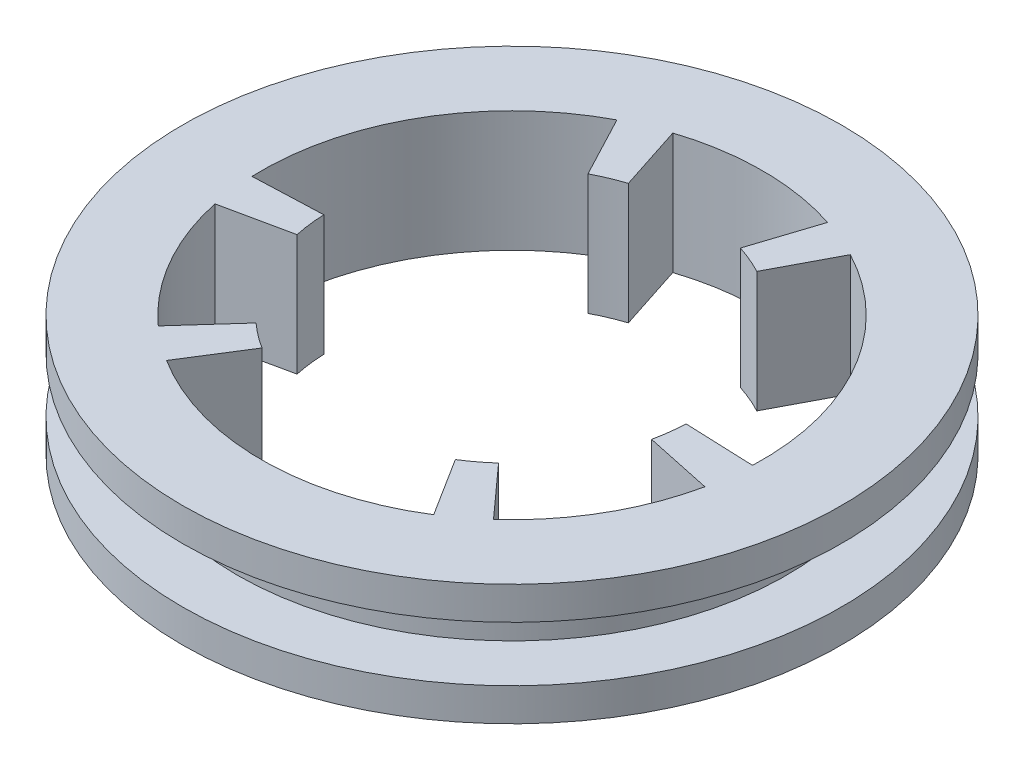
ISO-10303-21;
HEADER;
FILE_DESCRIPTION(('STEP AP214'),'2;1');
FILE_NAME('part.step','',(''),(''),'','','');
FILE_SCHEMA(('AUTOMOTIVE_DESIGN { 1 0 10303 214 1 1 1 1 }'));
ENDSEC;
DATA;
#1=APPLICATION_CONTEXT('core data for automotive mechanical design processes');
#2=APPLICATION_PROTOCOL_DEFINITION('international standard','automotive_design',2000,#1);
#3=PRODUCT_CONTEXT('',#1,'mechanical');
#4=PRODUCT('Part','Part','',(#3));
#5=PRODUCT_RELATED_PRODUCT_CATEGORY('part','',(#4));
#6=PRODUCT_DEFINITION_FORMATION('','',#4);
#7=PRODUCT_DEFINITION_CONTEXT('part definition',#1,'design');
#8=PRODUCT_DEFINITION('design','',#6,#7);
#9=PRODUCT_DEFINITION_SHAPE('','',#8);
#10=(LENGTH_UNIT() NAMED_UNIT(*) SI_UNIT(.MILLI.,.METRE.));
#11=(NAMED_UNIT(*) PLANE_ANGLE_UNIT() SI_UNIT($,.RADIAN.));
#12=(NAMED_UNIT(*) SI_UNIT($,.STERADIAN.) SOLID_ANGLE_UNIT());
#13=UNCERTAINTY_MEASURE_WITH_UNIT(LENGTH_MEASURE(1.E-05),#10,'distance_accuracy_value','');
#14=(GEOMETRIC_REPRESENTATION_CONTEXT(3) GLOBAL_UNCERTAINTY_ASSIGNED_CONTEXT((#13)) GLOBAL_UNIT_ASSIGNED_CONTEXT((#10,
#11,#12)) REPRESENTATION_CONTEXT('',''));
#15=CARTESIAN_POINT('',(0.,0.,0.));
#16=DIRECTION('',(0.,0.,1.));
#17=DIRECTION('',(1.,0.,0.));
#18=AXIS2_PLACEMENT_3D('',#15,#16,#17);
#19=CARTESIAN_POINT('',(-25.,2.5,0.));
#20=DIRECTION('',(0.,-1.,0.));
#21=DIRECTION('',(0.,0.,-1.));
#22=AXIS2_PLACEMENT_3D('',#19,#20,#21);
#23=PLANE('',#22);
#24=CARTESIAN_POINT('',(0.,2.5,0.));
#25=DIRECTION('',(0.,1.,0.));
#26=DIRECTION('',(0.,0.,1.));
#27=AXIS2_PLACEMENT_3D('',#24,#25,#26);
#28=CIRCLE('',#27,25.);
#29=CARTESIAN_POINT('',(0.,2.5,25.));
#30=VERTEX_POINT('',#29);
#31=EDGE_CURVE('E204',#30,#30,#28,.T.);
#32=ORIENTED_EDGE('',*,*,#31,.T.);
#33=EDGE_LOOP('',(#32));
#34=FACE_BOUND('',#33,.T.);
#35=CARTESIAN_POINT('',(0.,2.5,0.));
#36=DIRECTION('',(0.,1.,0.));
#37=DIRECTION('',(0.,0.,1.));
#38=AXIS2_PLACEMENT_3D('',#35,#36,#37);
#39=CIRCLE('',#38,30.);
#40=CARTESIAN_POINT('',(0.,2.5,30.));
#41=VERTEX_POINT('',#40);
#42=EDGE_CURVE('E11',#41,#41,#39,.T.);
#43=ORIENTED_EDGE('',*,*,#42,.F.);
#44=EDGE_LOOP('',(#43));
#45=FACE_BOUND('',#44,.T.);
#46=ADVANCED_FACE('F38',(#34,#45),#23,.T.);
#47=CARTESIAN_POINT('',(0.,19.9874111465534,0.));
#48=DIRECTION('',(0.,1.,0.));
#49=DIRECTION('',(0.,0.,1.));
#50=AXIS2_PLACEMENT_3D('',#47,#48,#49);
#51=CYLINDRICAL_SURFACE('',#50,30.);
#52=ORIENTED_EDGE('',*,*,#42,.T.);
#53=EDGE_LOOP('',(#52));
#54=FACE_BOUND('',#53,.T.);
#55=CARTESIAN_POINT('',(0.,5.5,0.));
#56=DIRECTION('',(0.,1.,0.));
#57=DIRECTION('',(0.,0.,1.));
#58=AXIS2_PLACEMENT_3D('',#55,#56,#57);
#59=CIRCLE('',#58,30.);
#60=CARTESIAN_POINT('',(0.,5.5,30.));
#61=VERTEX_POINT('',#60);
#62=EDGE_CURVE('E45',#61,#61,#59,.T.);
#63=ORIENTED_EDGE('',*,*,#62,.F.);
#64=EDGE_LOOP('',(#63));
#65=FACE_BOUND('',#64,.T.);
#66=ADVANCED_FACE('F339',(#54,#65),#51,.T.);
#67=CARTESIAN_POINT('',(-30.,5.5,0.));
#68=DIRECTION('',(0.,1.,0.));
#69=DIRECTION('',(0.,0.,1.));
#70=AXIS2_PLACEMENT_3D('',#67,#68,#69);
#71=PLANE('',#70);
#72=CARTESIAN_POINT('',(0.,5.5,0.));
#73=DIRECTION('',(0.,1.,0.));
#74=DIRECTION('',(0.,0.,1.));
#75=AXIS2_PLACEMENT_3D('',#72,#73,#74);
#76=CIRCLE('',#75,22.8);
#77=CARTESIAN_POINT('',(15.2561778249819,5.5,16.9437020208847));
#78=VERTEX_POINT('',#77);
#79=CARTESIAN_POINT('',(22.3017652967308,5.5,4.740386550645));
#80=VERTEX_POINT('',#79);
#81=EDGE_CURVE('E52',#78,#80,#76,.T.);
#82=ORIENTED_EDGE('',*,*,#81,.F.);
#83=DIRECTION('',(-0.669130606358854,0.,-0.743144825477398));
#84=VECTOR('',#83,1.);
#85=CARTESIAN_POINT('',(0.,5.5,0.));
#86=LINE('',#85,#84);
#87=CARTESIAN_POINT('',(11.0406550049211,5.5,12.2618896203771));
#88=VERTEX_POINT('',#87);
#89=EDGE_CURVE('E210',#78,#88,#86,.T.);
#90=ORIENTED_EDGE('',*,*,#89,.T.);
#91=CARTESIAN_POINT('',(0.,5.5,0.));
#92=DIRECTION('',(0.,1.,0.));
#93=DIRECTION('',(0.,0.,1.));
#94=AXIS2_PLACEMENT_3D('',#91,#92,#93);
#95=CIRCLE('',#94,16.5);
#96=CARTESIAN_POINT('',(8.79989737156065,5.5,13.9575));
#97=VERTEX_POINT('',#96);
#98=EDGE_CURVE('E229',#97,#88,#95,.T.);
#99=ORIENTED_EDGE('',*,*,#98,.F.);
#100=DIRECTION('',(0.533327113427918,0.,0.845909090909091));
#101=VECTOR('',#100,1.);
#102=CARTESIAN_POINT('',(0.,5.5,0.));
#103=LINE('',#102,#101);
#104=CARTESIAN_POINT('',(12.1598581861565,5.5,19.2867272727273));
#105=VERTEX_POINT('',#104);
#106=EDGE_CURVE('E275',#97,#105,#103,.T.);
#107=ORIENTED_EDGE('',*,*,#106,.T.);
#108=CARTESIAN_POINT('',(0.,5.5,0.));
#109=DIRECTION('',(0.,1.,0.));
#110=DIRECTION('',(0.,0.,1.));
#111=AXIS2_PLACEMENT_3D('',#108,#109,#110);
#112=CIRCLE('',#111,22.8);
#113=CARTESIAN_POINT('',(-12.1598581861565,5.5,19.2867272727273));
#114=VERTEX_POINT('',#113);
#115=EDGE_CURVE('E272',#114,#105,#112,.T.);
#116=ORIENTED_EDGE('',*,*,#115,.F.);
#117=DIRECTION('',(-0.533327113427918,0.,0.845909090909091));
#118=VECTOR('',#117,1.);
#119=CARTESIAN_POINT('',(0.,5.5,0.));
#120=LINE('',#119,#118);
#121=CARTESIAN_POINT('',(-8.79989737156065,5.5,13.9575));
#122=VERTEX_POINT('',#121);
#123=EDGE_CURVE('E269',#122,#114,#120,.T.);
#124=ORIENTED_EDGE('',*,*,#123,.F.);
#125=CARTESIAN_POINT('',(-11.0406550049214,5.5,12.2618896203769));
#126=VERTEX_POINT('',#125);
#127=EDGE_CURVE('E268',#126,#122,#95,.T.);
#128=ORIENTED_EDGE('',*,*,#127,.F.);
#129=DIRECTION('',(0.66913060635886,0.,-0.743144825477392));
#130=VECTOR('',#129,1.);
#131=CARTESIAN_POINT('',(-1.50830640652339E-13,5.5,-1.35808518847401E-13));
#132=LINE('',#131,#130);
#133=CARTESIAN_POINT('',(-15.2561778249822,5.5,16.9437020208844));
#134=VERTEX_POINT('',#133);
#135=EDGE_CURVE('E265',#134,#126,#132,.T.);
#136=ORIENTED_EDGE('',*,*,#135,.F.);
#137=CARTESIAN_POINT('',(0.,5.5,0.));
#138=DIRECTION('',(0.,1.,0.));
#139=DIRECTION('',(0.,0.,1.));
#140=AXIS2_PLACEMENT_3D('',#137,#138,#139);
#141=CIRCLE('',#140,22.8);
#142=CARTESIAN_POINT('',(-22.3017652967308,5.5,4.7403865506446));
#143=VERTEX_POINT('',#142);
#144=EDGE_CURVE('E262',#143,#134,#141,.T.);
#145=ORIENTED_EDGE('',*,*,#144,.F.);
#146=DIRECTION('',(0.978147600733809,0.,-0.207911690817745));
#147=VECTOR('',#146,1.);
#148=CARTESIAN_POINT('',(0.,5.5,0.));
#149=LINE('',#148,#147);
#150=CARTESIAN_POINT('',(-16.1394354121078,5.5,3.4305428984928));
#151=VERTEX_POINT('',#150);
#152=EDGE_CURVE('E259',#143,#151,#149,.T.);
#153=ORIENTED_EDGE('',*,*,#152,.T.);
#154=CARTESIAN_POINT('',(-16.4874982591016,5.5,0.642184674467354));
#155=VERTEX_POINT('',#154);
#156=EDGE_CURVE('E258',#155,#151,#95,.T.);
#157=ORIENTED_EDGE('',*,*,#156,.F.);
#158=DIRECTION('',(-0.999242318733432,0.,0.0389202833010516));
#159=VECTOR('',#158,1.);
#160=CARTESIAN_POINT('',(0.,5.5,0.));
#161=LINE('',#160,#159);
#162=CARTESIAN_POINT('',(-22.7827248671223,5.5,0.887382459263979));
#163=VERTEX_POINT('',#162);
#164=EDGE_CURVE('E255',#155,#163,#161,.T.);
#165=ORIENTED_EDGE('',*,*,#164,.T.);
#166=CARTESIAN_POINT('',(0.,5.5,0.));
#167=DIRECTION('',(0.,1.,0.));
#168=DIRECTION('',(0.,0.,1.));
#169=AXIS2_PLACEMENT_3D('',#166,#167,#168);
#170=CIRCLE('',#169,22.8);
#171=CARTESIAN_POINT('',(-10.6228666809656,5.5,-20.1741097319914));
#172=VERTEX_POINT('',#171);
#173=EDGE_CURVE('E252',#172,#163,#170,.T.);
#174=ORIENTED_EDGE('',*,*,#173,.F.);
#175=DIRECTION('',(-0.46591520530551,0.,-0.884829374210149));
#176=VECTOR('',#175,1.);
#177=CARTESIAN_POINT('',(0.,5.5,0.));
#178=LINE('',#177,#176);
#179=CARTESIAN_POINT('',(-7.68760088754091,5.5,-14.5996846744675));
#180=VERTEX_POINT('',#179);
#181=EDGE_CURVE('E249',#180,#172,#178,.T.);
#182=ORIENTED_EDGE('',*,*,#181,.F.);
#183=CARTESIAN_POINT('',(-5.0987804071865,5.5,-15.6924325188701));
#184=VERTEX_POINT('',#183);
#185=EDGE_CURVE('E248',#184,#180,#95,.T.);
#186=ORIENTED_EDGE('',*,*,#185,.F.);
#187=DIRECTION('',(0.309016994374939,0.,0.951056516295156));
#188=VECTOR('',#187,1.);
#189=CARTESIAN_POINT('',(0.,5.5,0.));
#190=LINE('',#189,#188);
#191=CARTESIAN_POINT('',(-7.04558747174862,5.5,-21.6840885715296));
#192=VERTEX_POINT('',#191);
#193=EDGE_CURVE('E245',#192,#184,#190,.T.);
#194=ORIENTED_EDGE('',*,*,#193,.F.);
#195=CARTESIAN_POINT('',(0.,5.5,0.));
#196=DIRECTION('',(0.,1.,0.));
#197=DIRECTION('',(0.,0.,1.));
#198=AXIS2_PLACEMENT_3D('',#195,#196,#197);
#199=CIRCLE('',#198,22.8);
#200=CARTESIAN_POINT('',(7.04558747174912,5.5,-21.6840885715294));
#201=VERTEX_POINT('',#200);
#202=EDGE_CURVE('E242',#201,#192,#199,.T.);
#203=ORIENTED_EDGE('',*,*,#202,.F.);
#204=DIRECTION('',(-0.309016994374961,0.,0.951056516295149));
#205=VECTOR('',#204,1.);
#206=CARTESIAN_POINT('',(0.,5.5,0.));
#207=LINE('',#206,#205);
#208=CARTESIAN_POINT('',(5.09878040718686,5.5,-15.69243251887));
#209=VERTEX_POINT('',#208);
#210=EDGE_CURVE('E239',#201,#209,#207,.T.);
#211=ORIENTED_EDGE('',*,*,#210,.T.);
#212=CARTESIAN_POINT('',(7.68760088754112,5.5,-14.5996846744674));
#213=VERTEX_POINT('',#212);
#214=EDGE_CURVE('E230',#213,#209,#95,.T.);
#215=ORIENTED_EDGE('',*,*,#214,.F.);
#216=DIRECTION('',(0.465915205305522,0.,-0.884829374210143));
#217=VECTOR('',#216,1.);
#218=CARTESIAN_POINT('',(0.,5.5,0.));
#219=LINE('',#218,#217);
#220=CARTESIAN_POINT('',(10.6228666809659,5.5,-20.1741097319913));
#221=VERTEX_POINT('',#220);
#222=EDGE_CURVE('E236',#213,#221,#219,.T.);
#223=ORIENTED_EDGE('',*,*,#222,.T.);
#224=CARTESIAN_POINT('',(0.,5.5,0.));
#225=DIRECTION('',(0.,1.,0.));
#226=DIRECTION('',(0.,0.,1.));
#227=AXIS2_PLACEMENT_3D('',#224,#225,#226);
#228=CIRCLE('',#227,22.8);
#229=CARTESIAN_POINT('',(22.7827248671222,5.5,0.887382459264295));
#230=VERTEX_POINT('',#229);
#231=EDGE_CURVE('E233',#230,#221,#228,.T.);
#232=ORIENTED_EDGE('',*,*,#231,.F.);
#233=DIRECTION('',(0.999242318733432,0.,0.0389202833010652));
#234=VECTOR('',#233,1.);
#235=CARTESIAN_POINT('',(0.,5.5,0.));
#236=LINE('',#235,#234);
#237=CARTESIAN_POINT('',(16.4874982591016,5.5,0.642184674467584));
#238=VERTEX_POINT('',#237);
#239=EDGE_CURVE('E228',#238,#230,#236,.T.);
#240=ORIENTED_EDGE('',*,*,#239,.F.);
#241=CARTESIAN_POINT('',(16.1394354121078,5.5,3.4305428984931));
#242=VERTEX_POINT('',#241);
#243=EDGE_CURVE('E225',#242,#238,#95,.T.);
#244=ORIENTED_EDGE('',*,*,#243,.F.);
#245=DIRECTION('',(-0.978147600733805,0.,-0.207911690817763));
#246=VECTOR('',#245,1.);
#247=CARTESIAN_POINT('',(0.,5.5,0.));
#248=LINE('',#247,#246);
#249=EDGE_CURVE('E218',#80,#242,#248,.T.);
#250=ORIENTED_EDGE('',*,*,#249,.F.);
#251=EDGE_LOOP('',(#82,#90,#99,#107,#116,#124,#128,#136,#145,#153,#157,#165,#174,#182,#186,#194,
#203,#211,#215,#223,#232,#240,#244,#250));
#252=FACE_BOUND('',#251,.T.);
#253=ORIENTED_EDGE('',*,*,#62,.T.);
#254=EDGE_LOOP('',(#253));
#255=FACE_BOUND('',#254,.T.);
#256=ADVANCED_FACE('F337',(#252,#255),#71,.T.);
#257=CARTESIAN_POINT('',(-30.,-5.5,0.));
#258=DIRECTION('',(0.,-1.,0.));
#259=DIRECTION('',(0.,0.,-1.));
#260=AXIS2_PLACEMENT_3D('',#257,#258,#259);
#261=PLANE('',#260);
#262=CARTESIAN_POINT('',(0.,-5.5,0.));
#263=DIRECTION('',(0.,-1.,0.));
#264=DIRECTION('',(0.,0.,-1.));
#265=AXIS2_PLACEMENT_3D('',#262,#263,#264);
#266=CIRCLE('',#265,22.8);
#267=CARTESIAN_POINT('',(15.2561778249819,-5.5,16.9437020208847));
#268=VERTEX_POINT('',#267);
#269=CARTESIAN_POINT('',(22.3017652967308,-5.5,4.740386550645));
#270=VERTEX_POINT('',#269);
#271=EDGE_CURVE('E208',#268,#270,#266,.F.);
#272=ORIENTED_EDGE('',*,*,#271,.T.);
#273=DIRECTION('',(-0.978147600733805,0.,-0.207911690817763));
#274=VECTOR('',#273,1.);
#275=CARTESIAN_POINT('',(0.,-5.5,0.));
#276=LINE('',#275,#274);
#277=CARTESIAN_POINT('',(16.1394354121078,-5.5,3.4305428984931));
#278=VERTEX_POINT('',#277);
#279=EDGE_CURVE('E197',#270,#278,#276,.T.);
#280=ORIENTED_EDGE('',*,*,#279,.T.);
#281=CARTESIAN_POINT('',(0.,-5.5,0.));
#282=DIRECTION('',(0.,-1.,0.));
#283=DIRECTION('',(0.,0.,-1.));
#284=AXIS2_PLACEMENT_3D('',#281,#282,#283);
#285=CIRCLE('',#284,16.5);
#286=CARTESIAN_POINT('',(16.4874982591016,-5.5,0.642184674467584));
#287=VERTEX_POINT('',#286);
#288=EDGE_CURVE('E502',#278,#287,#285,.F.);
#289=ORIENTED_EDGE('',*,*,#288,.T.);
#290=DIRECTION('',(0.999242318733432,0.,0.0389202833010652));
#291=VECTOR('',#290,1.);
#292=CARTESIAN_POINT('',(0.,-5.5,0.));
#293=LINE('',#292,#291);
#294=CARTESIAN_POINT('',(22.7827248671222,-5.5,0.887382459264295));
#295=VERTEX_POINT('',#294);
#296=EDGE_CURVE('E499',#287,#295,#293,.T.);
#297=ORIENTED_EDGE('',*,*,#296,.T.);
#298=CARTESIAN_POINT('',(0.,-5.5,0.));
#299=DIRECTION('',(0.,-1.,0.));
#300=DIRECTION('',(0.,0.,-1.));
#301=AXIS2_PLACEMENT_3D('',#298,#299,#300);
#302=CIRCLE('',#301,22.8);
#303=CARTESIAN_POINT('',(10.6228666809659,-5.5,-20.1741097319913));
#304=VERTEX_POINT('',#303);
#305=EDGE_CURVE('E496',#295,#304,#302,.F.);
#306=ORIENTED_EDGE('',*,*,#305,.T.);
#307=DIRECTION('',(0.465915205305522,0.,-0.884829374210143));
#308=VECTOR('',#307,1.);
#309=CARTESIAN_POINT('',(0.,-5.5,0.));
#310=LINE('',#309,#308);
#311=CARTESIAN_POINT('',(7.68760088754112,-5.5,-14.5996846744674));
#312=VERTEX_POINT('',#311);
#313=EDGE_CURVE('E494',#312,#304,#310,.T.);
#314=ORIENTED_EDGE('',*,*,#313,.F.);
#315=CARTESIAN_POINT('',(0.,-5.5,0.));
#316=DIRECTION('',(0.,-1.,0.));
#317=DIRECTION('',(0.,0.,-1.));
#318=AXIS2_PLACEMENT_3D('',#315,#316,#317);
#319=CIRCLE('',#318,16.5);
#320=CARTESIAN_POINT('',(5.09878040718686,-5.5,-15.69243251887));
#321=VERTEX_POINT('',#320);
#322=EDGE_CURVE('E491',#312,#321,#319,.F.);
#323=ORIENTED_EDGE('',*,*,#322,.T.);
#324=DIRECTION('',(-0.309016994374961,0.,0.951056516295149));
#325=VECTOR('',#324,1.);
#326=CARTESIAN_POINT('',(0.,-5.5,0.));
#327=LINE('',#326,#325);
#328=CARTESIAN_POINT('',(7.04558747174912,-5.5,-21.6840885715294));
#329=VERTEX_POINT('',#328);
#330=EDGE_CURVE('E489',#329,#321,#327,.T.);
#331=ORIENTED_EDGE('',*,*,#330,.F.);
#332=CARTESIAN_POINT('',(0.,-5.5,0.));
#333=DIRECTION('',(0.,-1.,0.));
#334=DIRECTION('',(0.,0.,-1.));
#335=AXIS2_PLACEMENT_3D('',#332,#333,#334);
#336=CIRCLE('',#335,22.8);
#337=CARTESIAN_POINT('',(-7.04558747174862,-5.5,-21.6840885715296));
#338=VERTEX_POINT('',#337);
#339=EDGE_CURVE('E486',#329,#338,#336,.F.);
#340=ORIENTED_EDGE('',*,*,#339,.T.);
#341=DIRECTION('',(0.309016994374939,0.,0.951056516295156));
#342=VECTOR('',#341,1.);
#343=CARTESIAN_POINT('',(0.,-5.5,0.));
#344=LINE('',#343,#342);
#345=CARTESIAN_POINT('',(-5.0987804071865,-5.5,-15.6924325188701));
#346=VERTEX_POINT('',#345);
#347=EDGE_CURVE('E483',#338,#346,#344,.T.);
#348=ORIENTED_EDGE('',*,*,#347,.T.);
#349=CARTESIAN_POINT('',(0.,-5.5,0.));
#350=DIRECTION('',(0.,-1.,0.));
#351=DIRECTION('',(0.,0.,-1.));
#352=AXIS2_PLACEMENT_3D('',#349,#350,#351);
#353=CIRCLE('',#352,16.5);
#354=CARTESIAN_POINT('',(-7.68760088754091,-5.5,-14.5996846744675));
#355=VERTEX_POINT('',#354);
#356=EDGE_CURVE('E480',#346,#355,#353,.F.);
#357=ORIENTED_EDGE('',*,*,#356,.T.);
#358=DIRECTION('',(-0.46591520530551,0.,-0.884829374210149));
#359=VECTOR('',#358,1.);
#360=CARTESIAN_POINT('',(0.,-5.5,0.));
#361=LINE('',#360,#359);
#362=CARTESIAN_POINT('',(-10.6228666809656,-5.5,-20.1741097319914));
#363=VERTEX_POINT('',#362);
#364=EDGE_CURVE('E477',#355,#363,#361,.T.);
#365=ORIENTED_EDGE('',*,*,#364,.T.);
#366=CARTESIAN_POINT('',(0.,-5.5,0.));
#367=DIRECTION('',(0.,-1.,0.));
#368=DIRECTION('',(0.,0.,-1.));
#369=AXIS2_PLACEMENT_3D('',#366,#367,#368);
#370=CIRCLE('',#369,22.8);
#371=CARTESIAN_POINT('',(-22.7827248671223,-5.5,0.887382459263979));
#372=VERTEX_POINT('',#371);
#373=EDGE_CURVE('E474',#363,#372,#370,.F.);
#374=ORIENTED_EDGE('',*,*,#373,.T.);
#375=DIRECTION('',(-0.999242318733432,0.,0.0389202833010516));
#376=VECTOR('',#375,1.);
#377=CARTESIAN_POINT('',(0.,-5.5,0.));
#378=LINE('',#377,#376);
#379=CARTESIAN_POINT('',(-16.4874982591016,-5.5,0.642184674467354));
#380=VERTEX_POINT('',#379);
#381=EDGE_CURVE('E472',#380,#372,#378,.T.);
#382=ORIENTED_EDGE('',*,*,#381,.F.);
#383=CARTESIAN_POINT('',(0.,-5.5,0.));
#384=DIRECTION('',(0.,-1.,0.));
#385=DIRECTION('',(0.,0.,-1.));
#386=AXIS2_PLACEMENT_3D('',#383,#384,#385);
#387=CIRCLE('',#386,16.5);
#388=CARTESIAN_POINT('',(-16.1394354121078,-5.5,3.4305428984928));
#389=VERTEX_POINT('',#388);
#390=EDGE_CURVE('E469',#380,#389,#387,.F.);
#391=ORIENTED_EDGE('',*,*,#390,.T.);
#392=DIRECTION('',(0.978147600733809,0.,-0.207911690817745));
#393=VECTOR('',#392,1.);
#394=CARTESIAN_POINT('',(0.,-5.5,0.));
#395=LINE('',#394,#393);
#396=CARTESIAN_POINT('',(-22.3017652967308,-5.5,4.7403865506446));
#397=VERTEX_POINT('',#396);
#398=EDGE_CURVE('E467',#397,#389,#395,.T.);
#399=ORIENTED_EDGE('',*,*,#398,.F.);
#400=CARTESIAN_POINT('',(0.,-5.5,0.));
#401=DIRECTION('',(0.,-1.,0.));
#402=DIRECTION('',(0.,0.,-1.));
#403=AXIS2_PLACEMENT_3D('',#400,#401,#402);
#404=CIRCLE('',#403,22.8);
#405=CARTESIAN_POINT('',(-15.2561778249822,-5.5,16.9437020208844));
#406=VERTEX_POINT('',#405);
#407=EDGE_CURVE('E464',#397,#406,#404,.F.);
#408=ORIENTED_EDGE('',*,*,#407,.T.);
#409=DIRECTION('',(0.66913060635886,0.,-0.743144825477392));
#410=VECTOR('',#409,1.);
#411=CARTESIAN_POINT('',(-1.50830640652339E-13,-5.5,-1.35808518847401E-13));
#412=LINE('',#411,#410);
#413=CARTESIAN_POINT('',(-11.0406550049214,-5.5,12.2618896203769));
#414=VERTEX_POINT('',#413);
#415=EDGE_CURVE('E461',#406,#414,#412,.T.);
#416=ORIENTED_EDGE('',*,*,#415,.T.);
#417=CARTESIAN_POINT('',(0.,-5.5,0.));
#418=DIRECTION('',(0.,-1.,0.));
#419=DIRECTION('',(0.,0.,-1.));
#420=AXIS2_PLACEMENT_3D('',#417,#418,#419);
#421=CIRCLE('',#420,16.5);
#422=CARTESIAN_POINT('',(-8.79989737156065,-5.5,13.9575));
#423=VERTEX_POINT('',#422);
#424=EDGE_CURVE('E458',#414,#423,#421,.F.);
#425=ORIENTED_EDGE('',*,*,#424,.T.);
#426=DIRECTION('',(-0.533327113427918,0.,0.845909090909091));
#427=VECTOR('',#426,1.);
#428=CARTESIAN_POINT('',(0.,-5.5,0.));
#429=LINE('',#428,#427);
#430=CARTESIAN_POINT('',(-12.1598581861565,-5.5,19.2867272727273));
#431=VERTEX_POINT('',#430);
#432=EDGE_CURVE('E455',#423,#431,#429,.T.);
#433=ORIENTED_EDGE('',*,*,#432,.T.);
#434=CARTESIAN_POINT('',(0.,-5.5,0.));
#435=DIRECTION('',(0.,-1.,0.));
#436=DIRECTION('',(0.,0.,-1.));
#437=AXIS2_PLACEMENT_3D('',#434,#435,#436);
#438=CIRCLE('',#437,22.8);
#439=CARTESIAN_POINT('',(12.1598581861565,-5.5,19.2867272727273));
#440=VERTEX_POINT('',#439);
#441=EDGE_CURVE('E451',#431,#440,#438,.F.);
#442=ORIENTED_EDGE('',*,*,#441,.T.);
#443=DIRECTION('',(0.533327113427918,0.,0.845909090909091));
#444=VECTOR('',#443,1.);
#445=CARTESIAN_POINT('',(0.,-5.5,0.));
#446=LINE('',#445,#444);
#447=CARTESIAN_POINT('',(8.79989737156065,-5.5,13.9575));
#448=VERTEX_POINT('',#447);
#449=EDGE_CURVE('E450',#448,#440,#446,.T.);
#450=ORIENTED_EDGE('',*,*,#449,.F.);
#451=CARTESIAN_POINT('',(0.,-5.5,0.));
#452=DIRECTION('',(0.,-1.,0.));
#453=DIRECTION('',(0.,0.,-1.));
#454=AXIS2_PLACEMENT_3D('',#451,#452,#453);
#455=CIRCLE('',#454,16.5);
#456=CARTESIAN_POINT('',(11.0406550049211,-5.5,12.2618896203771));
#457=VERTEX_POINT('',#456);
#458=EDGE_CURVE('E220',#448,#457,#455,.F.);
#459=ORIENTED_EDGE('',*,*,#458,.T.);
#460=DIRECTION('',(-0.669130606358854,0.,-0.743144825477398));
#461=VECTOR('',#460,1.);
#462=CARTESIAN_POINT('',(0.,-5.5,0.));
#463=LINE('',#462,#461);
#464=EDGE_CURVE('E216',#268,#457,#463,.T.);
#465=ORIENTED_EDGE('',*,*,#464,.F.);
#466=EDGE_LOOP('',(#272,#280,#289,#297,#306,#314,#323,#331,#340,#348,#357,#365,#374,#382,#391,
#399,#408,#416,#425,#433,#442,#450,#459,#465));
#467=FACE_BOUND('',#466,.T.);
#468=CARTESIAN_POINT('',(0.,-5.5,0.));
#469=DIRECTION('',(0.,1.,0.));
#470=DIRECTION('',(0.,0.,1.));
#471=AXIS2_PLACEMENT_3D('',#468,#469,#470);
#472=CIRCLE('',#471,30.);
#473=CARTESIAN_POINT('',(0.,-5.5,30.));
#474=VERTEX_POINT('',#473);
#475=EDGE_CURVE('E332',#474,#474,#472,.T.);
#476=ORIENTED_EDGE('',*,*,#475,.F.);
#477=EDGE_LOOP('',(#476));
#478=FACE_BOUND('',#477,.T.);
#479=ADVANCED_FACE('F213',(#467,#478),#261,.T.);
#480=CARTESIAN_POINT('',(0.,19.9874111465534,0.));
#481=DIRECTION('',(0.,1.,0.));
#482=DIRECTION('',(0.,0.,1.));
#483=AXIS2_PLACEMENT_3D('',#480,#481,#482);
#484=CYLINDRICAL_SURFACE('',#483,30.);
#485=ORIENTED_EDGE('',*,*,#475,.T.);
#486=EDGE_LOOP('',(#485));
#487=FACE_BOUND('',#486,.T.);
#488=CARTESIAN_POINT('',(0.,-2.5,0.));
#489=DIRECTION('',(0.,1.,0.));
#490=DIRECTION('',(0.,0.,1.));
#491=AXIS2_PLACEMENT_3D('',#488,#489,#490);
#492=CIRCLE('',#491,30.);
#493=CARTESIAN_POINT('',(0.,-2.5,30.));
#494=VERTEX_POINT('',#493);
#495=EDGE_CURVE('E329',#494,#494,#492,.T.);
#496=ORIENTED_EDGE('',*,*,#495,.F.);
#497=EDGE_LOOP('',(#496));
#498=FACE_BOUND('',#497,.T.);
#499=ADVANCED_FACE('F353',(#487,#498),#484,.T.);
#500=CARTESIAN_POINT('',(-25.,-2.5,0.));
#501=DIRECTION('',(0.,1.,0.));
#502=DIRECTION('',(0.,0.,1.));
#503=AXIS2_PLACEMENT_3D('',#500,#501,#502);
#504=PLANE('',#503);
#505=ORIENTED_EDGE('',*,*,#495,.T.);
#506=EDGE_LOOP('',(#505));
#507=FACE_BOUND('',#506,.T.);
#508=CARTESIAN_POINT('',(0.,-2.5,0.));
#509=DIRECTION('',(0.,1.,0.));
#510=DIRECTION('',(0.,0.,1.));
#511=AXIS2_PLACEMENT_3D('',#508,#509,#510);
#512=CIRCLE('',#511,25.);
#513=CARTESIAN_POINT('',(0.,-2.5,25.));
#514=VERTEX_POINT('',#513);
#515=EDGE_CURVE('E326',#514,#514,#512,.T.);
#516=ORIENTED_EDGE('',*,*,#515,.F.);
#517=EDGE_LOOP('',(#516));
#518=FACE_BOUND('',#517,.T.);
#519=ADVANCED_FACE('F356',(#507,#518),#504,.T.);
#520=CARTESIAN_POINT('',(0.,19.9874111465534,0.));
#521=DIRECTION('',(0.,1.,0.));
#522=DIRECTION('',(0.,0.,1.));
#523=AXIS2_PLACEMENT_3D('',#520,#521,#522);
#524=CYLINDRICAL_SURFACE('',#523,25.);
#525=ORIENTED_EDGE('',*,*,#515,.T.);
#526=EDGE_LOOP('',(#525));
#527=FACE_BOUND('',#526,.T.);
#528=ORIENTED_EDGE('',*,*,#31,.F.);
#529=EDGE_LOOP('',(#528));
#530=FACE_BOUND('',#529,.T.);
#531=ADVANCED_FACE('F360',(#527,#530),#524,.T.);
#532=CARTESIAN_POINT('',(0.,-5.501,0.));
#533=DIRECTION('',(0.,1.,0.));
#534=DIRECTION('',(0.,0.,1.));
#535=AXIS2_PLACEMENT_3D('',#532,#533,#534);
#536=CYLINDRICAL_SURFACE('',#535,22.8);
#537=DIRECTION('',(0.,1.,0.));
#538=VECTOR('',#537,1.);
#539=CARTESIAN_POINT('',(15.2561778249819,-5.501,16.9437020208847));
#540=LINE('',#539,#538);
#541=EDGE_CURVE('E205',#268,#78,#540,.T.);
#542=ORIENTED_EDGE('',*,*,#541,.T.);
#543=ORIENTED_EDGE('',*,*,#81,.T.);
#544=DIRECTION('',(0.,1.,0.));
#545=VECTOR('',#544,1.);
#546=CARTESIAN_POINT('',(22.3017652967308,-5.501,4.740386550645));
#547=LINE('',#546,#545);
#548=EDGE_CURVE('E199',#270,#80,#547,.T.);
#549=ORIENTED_EDGE('',*,*,#548,.F.);
#550=ORIENTED_EDGE('',*,*,#271,.F.);
#551=EDGE_LOOP('',(#542,#543,#549,#550));
#552=FACE_BOUND('',#551,.T.);
#553=ADVANCED_FACE('F207',(#552),#536,.F.);
#554=CARTESIAN_POINT('',(0.,-5.501,0.));
#555=DIRECTION('',(0.743144825477398,0.,-0.669130606358854));
#556=DIRECTION('',(-0.669130606358854,0.,-0.743144825477398));
#557=AXIS2_PLACEMENT_3D('',#554,#555,#556);
#558=PLANE('',#557);
#559=ORIENTED_EDGE('',*,*,#464,.T.);
#560=DIRECTION('',(0.,1.,0.));
#561=VECTOR('',#560,1.);
#562=CARTESIAN_POINT('',(11.0406550049211,-5.501,12.2618896203771));
#563=LINE('',#562,#561);
#564=EDGE_CURVE('E281',#457,#88,#563,.T.);
#565=ORIENTED_EDGE('',*,*,#564,.T.);
#566=ORIENTED_EDGE('',*,*,#89,.F.);
#567=ORIENTED_EDGE('',*,*,#541,.F.);
#568=EDGE_LOOP('',(#559,#565,#566,#567));
#569=FACE_BOUND('',#568,.T.);
#570=ADVANCED_FACE('F367',(#569),#558,.T.);
#571=CARTESIAN_POINT('',(0.,-5.501,0.));
#572=DIRECTION('',(0.,1.,0.));
#573=DIRECTION('',(0.,0.,1.));
#574=AXIS2_PLACEMENT_3D('',#571,#572,#573);
#575=CYLINDRICAL_SURFACE('',#574,16.5);
#576=DIRECTION('',(0.,1.,0.));
#577=VECTOR('',#576,1.);
#578=CARTESIAN_POINT('',(8.79989737156065,-5.501,13.9575));
#579=LINE('',#578,#577);
#580=EDGE_CURVE('E283',#448,#97,#579,.T.);
#581=ORIENTED_EDGE('',*,*,#580,.T.);
#582=ORIENTED_EDGE('',*,*,#98,.T.);
#583=ORIENTED_EDGE('',*,*,#564,.F.);
#584=ORIENTED_EDGE('',*,*,#458,.F.);
#585=EDGE_LOOP('',(#581,#582,#583,#584));
#586=FACE_BOUND('',#585,.T.);
#587=ADVANCED_FACE('F434',(#586),#575,.F.);
#588=CARTESIAN_POINT('',(0.,-5.501,0.));
#589=DIRECTION('',(-0.845909090909091,0.,0.533327113427918));
#590=DIRECTION('',(0.533327113427918,0.,0.845909090909091));
#591=AXIS2_PLACEMENT_3D('',#588,#589,#590);
#592=PLANE('',#591);
#593=ORIENTED_EDGE('',*,*,#449,.T.);
#594=DIRECTION('',(0.,1.,0.));
#595=VECTOR('',#594,1.);
#596=CARTESIAN_POINT('',(12.1598581861565,-5.501,19.2867272727273));
#597=LINE('',#596,#595);
#598=EDGE_CURVE('E285',#440,#105,#597,.T.);
#599=ORIENTED_EDGE('',*,*,#598,.T.);
#600=ORIENTED_EDGE('',*,*,#106,.F.);
#601=ORIENTED_EDGE('',*,*,#580,.F.);
#602=EDGE_LOOP('',(#593,#599,#600,#601));
#603=FACE_BOUND('',#602,.T.);
#604=ADVANCED_FACE('F430',(#603),#592,.T.);
#605=CARTESIAN_POINT('',(0.,-5.501,0.));
#606=DIRECTION('',(0.,1.,0.));
#607=DIRECTION('',(0.,0.,1.));
#608=AXIS2_PLACEMENT_3D('',#605,#606,#607);
#609=CYLINDRICAL_SURFACE('',#608,22.8);
#610=DIRECTION('',(0.,1.,0.));
#611=VECTOR('',#610,1.);
#612=CARTESIAN_POINT('',(-12.1598581861565,-5.501,19.2867272727273));
#613=LINE('',#612,#611);
#614=EDGE_CURVE('E287',#431,#114,#613,.T.);
#615=ORIENTED_EDGE('',*,*,#614,.T.);
#616=ORIENTED_EDGE('',*,*,#115,.T.);
#617=ORIENTED_EDGE('',*,*,#598,.F.);
#618=ORIENTED_EDGE('',*,*,#441,.F.);
#619=EDGE_LOOP('',(#615,#616,#617,#618));
#620=FACE_BOUND('',#619,.T.);
#621=ADVANCED_FACE('F426',(#620),#609,.F.);
#622=CARTESIAN_POINT('',(0.,-5.501,0.));
#623=DIRECTION('',(-0.845909090909091,0.,-0.533327113427918));
#624=DIRECTION('',(-0.533327113427918,0.,0.845909090909091));
#625=AXIS2_PLACEMENT_3D('',#622,#623,#624);
#626=PLANE('',#625);
#627=DIRECTION('',(0.,1.,0.));
#628=VECTOR('',#627,1.);
#629=CARTESIAN_POINT('',(-8.79989737156065,-5.501,13.9575));
#630=LINE('',#629,#628);
#631=EDGE_CURVE('E289',#423,#122,#630,.T.);
#632=ORIENTED_EDGE('',*,*,#631,.T.);
#633=ORIENTED_EDGE('',*,*,#123,.T.);
#634=ORIENTED_EDGE('',*,*,#614,.F.);
#635=ORIENTED_EDGE('',*,*,#432,.F.);
#636=EDGE_LOOP('',(#632,#633,#634,#635));
#637=FACE_BOUND('',#636,.T.);
#638=ADVANCED_FACE('F423',(#637),#626,.F.);
#639=DIRECTION('',(0.,1.,0.));
#640=VECTOR('',#639,1.);
#641=CARTESIAN_POINT('',(-11.0406550049214,-5.501,12.2618896203769));
#642=LINE('',#641,#640);
#643=EDGE_CURVE('E291',#414,#126,#642,.T.);
#644=ORIENTED_EDGE('',*,*,#643,.T.);
#645=ORIENTED_EDGE('',*,*,#127,.T.);
#646=ORIENTED_EDGE('',*,*,#631,.F.);
#647=ORIENTED_EDGE('',*,*,#424,.F.);
#648=EDGE_LOOP('',(#644,#645,#646,#647));
#649=FACE_BOUND('',#648,.T.);
#650=ADVANCED_FACE('F421',(#649),#575,.F.);
#651=CARTESIAN_POINT('',(-1.50830640652339E-13,-5.501,-1.35808518847401E-13));
#652=DIRECTION('',(0.743144825477392,0.,0.66913060635886));
#653=DIRECTION('',(0.66913060635886,0.,-0.743144825477392));
#654=AXIS2_PLACEMENT_3D('',#651,#652,#653);
#655=PLANE('',#654);
#656=DIRECTION('',(0.,1.,0.));
#657=VECTOR('',#656,1.);
#658=CARTESIAN_POINT('',(-15.2561778249822,-5.501,16.9437020208844));
#659=LINE('',#658,#657);
#660=EDGE_CURVE('E293',#406,#134,#659,.T.);
#661=ORIENTED_EDGE('',*,*,#660,.T.);
#662=ORIENTED_EDGE('',*,*,#135,.T.);
#663=ORIENTED_EDGE('',*,*,#643,.F.);
#664=ORIENTED_EDGE('',*,*,#415,.F.);
#665=EDGE_LOOP('',(#661,#662,#663,#664));
#666=FACE_BOUND('',#665,.T.);
#667=ADVANCED_FACE('F417',(#666),#655,.F.);
#668=CARTESIAN_POINT('',(0.,-5.501,0.));
#669=DIRECTION('',(0.,1.,0.));
#670=DIRECTION('',(0.,0.,1.));
#671=AXIS2_PLACEMENT_3D('',#668,#669,#670);
#672=CYLINDRICAL_SURFACE('',#671,22.8);
#673=DIRECTION('',(0.,1.,0.));
#674=VECTOR('',#673,1.);
#675=CARTESIAN_POINT('',(-22.3017652967308,-5.501,4.7403865506446));
#676=LINE('',#675,#674);
#677=EDGE_CURVE('E295',#397,#143,#676,.T.);
#678=ORIENTED_EDGE('',*,*,#677,.T.);
#679=ORIENTED_EDGE('',*,*,#144,.T.);
#680=ORIENTED_EDGE('',*,*,#660,.F.);
#681=ORIENTED_EDGE('',*,*,#407,.F.);
#682=EDGE_LOOP('',(#678,#679,#680,#681));
#683=FACE_BOUND('',#682,.T.);
#684=ADVANCED_FACE('F413',(#683),#672,.F.);
#685=CARTESIAN_POINT('',(0.,-5.501,0.));
#686=DIRECTION('',(0.207911690817745,0.,0.978147600733809));
#687=DIRECTION('',(0.978147600733809,0.,-0.207911690817745));
#688=AXIS2_PLACEMENT_3D('',#685,#686,#687);
#689=PLANE('',#688);
#690=ORIENTED_EDGE('',*,*,#398,.T.);
#691=DIRECTION('',(0.,1.,0.));
#692=VECTOR('',#691,1.);
#693=CARTESIAN_POINT('',(-16.1394354121078,-5.501,3.4305428984928));
#694=LINE('',#693,#692);
#695=EDGE_CURVE('E297',#389,#151,#694,.T.);
#696=ORIENTED_EDGE('',*,*,#695,.T.);
#697=ORIENTED_EDGE('',*,*,#152,.F.);
#698=ORIENTED_EDGE('',*,*,#677,.F.);
#699=EDGE_LOOP('',(#690,#696,#697,#698));
#700=FACE_BOUND('',#699,.T.);
#701=ADVANCED_FACE('F410',(#700),#689,.T.);
#702=DIRECTION('',(0.,1.,0.));
#703=VECTOR('',#702,1.);
#704=CARTESIAN_POINT('',(-16.4874982591016,-5.501,0.642184674467354));
#705=LINE('',#704,#703);
#706=EDGE_CURVE('E299',#380,#155,#705,.T.);
#707=ORIENTED_EDGE('',*,*,#706,.T.);
#708=ORIENTED_EDGE('',*,*,#156,.T.);
#709=ORIENTED_EDGE('',*,*,#695,.F.);
#710=ORIENTED_EDGE('',*,*,#390,.F.);
#711=EDGE_LOOP('',(#707,#708,#709,#710));
#712=FACE_BOUND('',#711,.T.);
#713=ADVANCED_FACE('F408',(#712),#575,.F.);
#714=CARTESIAN_POINT('',(0.,-5.501,0.));
#715=DIRECTION('',(-0.0389202833010516,0.,-0.999242318733432));
#716=DIRECTION('',(-0.999242318733432,0.,0.0389202833010516));
#717=AXIS2_PLACEMENT_3D('',#714,#715,#716);
#718=PLANE('',#717);
#719=ORIENTED_EDGE('',*,*,#381,.T.);
#720=DIRECTION('',(0.,1.,0.));
#721=VECTOR('',#720,1.);
#722=CARTESIAN_POINT('',(-22.7827248671223,-5.501,0.887382459263979));
#723=LINE('',#722,#721);
#724=EDGE_CURVE('E301',#372,#163,#723,.T.);
#725=ORIENTED_EDGE('',*,*,#724,.T.);
#726=ORIENTED_EDGE('',*,*,#164,.F.);
#727=ORIENTED_EDGE('',*,*,#706,.F.);
#728=EDGE_LOOP('',(#719,#725,#726,#727));
#729=FACE_BOUND('',#728,.T.);
#730=ADVANCED_FACE('F404',(#729),#718,.T.);
#731=CARTESIAN_POINT('',(0.,-5.501,0.));
#732=DIRECTION('',(0.,1.,0.));
#733=DIRECTION('',(0.,0.,1.));
#734=AXIS2_PLACEMENT_3D('',#731,#732,#733);
#735=CYLINDRICAL_SURFACE('',#734,22.8);
#736=DIRECTION('',(0.,1.,0.));
#737=VECTOR('',#736,1.);
#738=CARTESIAN_POINT('',(-10.6228666809656,-5.501,-20.1741097319914));
#739=LINE('',#738,#737);
#740=EDGE_CURVE('E303',#363,#172,#739,.T.);
#741=ORIENTED_EDGE('',*,*,#740,.T.);
#742=ORIENTED_EDGE('',*,*,#173,.T.);
#743=ORIENTED_EDGE('',*,*,#724,.F.);
#744=ORIENTED_EDGE('',*,*,#373,.F.);
#745=EDGE_LOOP('',(#741,#742,#743,#744));
#746=FACE_BOUND('',#745,.T.);
#747=ADVANCED_FACE('F400',(#746),#735,.F.);
#748=CARTESIAN_POINT('',(0.,-5.501,0.));
#749=DIRECTION('',(0.884829374210149,0.,-0.46591520530551));
#750=DIRECTION('',(-0.46591520530551,0.,-0.884829374210149));
#751=AXIS2_PLACEMENT_3D('',#748,#749,#750);
#752=PLANE('',#751);
#753=DIRECTION('',(0.,1.,0.));
#754=VECTOR('',#753,1.);
#755=CARTESIAN_POINT('',(-7.68760088754091,-5.501,-14.5996846744675));
#756=LINE('',#755,#754);
#757=EDGE_CURVE('E305',#355,#180,#756,.T.);
#758=ORIENTED_EDGE('',*,*,#757,.T.);
#759=ORIENTED_EDGE('',*,*,#181,.T.);
#760=ORIENTED_EDGE('',*,*,#740,.F.);
#761=ORIENTED_EDGE('',*,*,#364,.F.);
#762=EDGE_LOOP('',(#758,#759,#760,#761));
#763=FACE_BOUND('',#762,.T.);
#764=ADVANCED_FACE('F397',(#763),#752,.F.);
#765=DIRECTION('',(0.,1.,0.));
#766=VECTOR('',#765,1.);
#767=CARTESIAN_POINT('',(-5.0987804071865,-5.501,-15.6924325188701));
#768=LINE('',#767,#766);
#769=EDGE_CURVE('E307',#346,#184,#768,.T.);
#770=ORIENTED_EDGE('',*,*,#769,.T.);
#771=ORIENTED_EDGE('',*,*,#185,.T.);
#772=ORIENTED_EDGE('',*,*,#757,.F.);
#773=ORIENTED_EDGE('',*,*,#356,.F.);
#774=EDGE_LOOP('',(#770,#771,#772,#773));
#775=FACE_BOUND('',#774,.T.);
#776=ADVANCED_FACE('F395',(#775),#575,.F.);
#777=CARTESIAN_POINT('',(0.,-5.501,0.));
#778=DIRECTION('',(-0.951056516295156,0.,0.309016994374939));
#779=DIRECTION('',(0.309016994374939,0.,0.951056516295156));
#780=AXIS2_PLACEMENT_3D('',#777,#778,#779);
#781=PLANE('',#780);
#782=DIRECTION('',(0.,1.,0.));
#783=VECTOR('',#782,1.);
#784=CARTESIAN_POINT('',(-7.04558747174862,-5.501,-21.6840885715296));
#785=LINE('',#784,#783);
#786=EDGE_CURVE('E309',#338,#192,#785,.T.);
#787=ORIENTED_EDGE('',*,*,#786,.T.);
#788=ORIENTED_EDGE('',*,*,#193,.T.);
#789=ORIENTED_EDGE('',*,*,#769,.F.);
#790=ORIENTED_EDGE('',*,*,#347,.F.);
#791=EDGE_LOOP('',(#787,#788,#789,#790));
#792=FACE_BOUND('',#791,.T.);
#793=ADVANCED_FACE('F391',(#792),#781,.F.);
#794=CARTESIAN_POINT('',(0.,-5.501,0.));
#795=DIRECTION('',(0.,1.,0.));
#796=DIRECTION('',(0.,0.,1.));
#797=AXIS2_PLACEMENT_3D('',#794,#795,#796);
#798=CYLINDRICAL_SURFACE('',#797,22.8);
#799=DIRECTION('',(0.,1.,0.));
#800=VECTOR('',#799,1.);
#801=CARTESIAN_POINT('',(7.04558747174912,-5.501,-21.6840885715294));
#802=LINE('',#801,#800);
#803=EDGE_CURVE('E311',#329,#201,#802,.T.);
#804=ORIENTED_EDGE('',*,*,#803,.T.);
#805=ORIENTED_EDGE('',*,*,#202,.T.);
#806=ORIENTED_EDGE('',*,*,#786,.F.);
#807=ORIENTED_EDGE('',*,*,#339,.F.);
#808=EDGE_LOOP('',(#804,#805,#806,#807));
#809=FACE_BOUND('',#808,.T.);
#810=ADVANCED_FACE('F387',(#809),#798,.F.);
#811=CARTESIAN_POINT('',(0.,-5.501,0.));
#812=DIRECTION('',(-0.951056516295149,0.,-0.309016994374961));
#813=DIRECTION('',(-0.309016994374961,0.,0.951056516295149));
#814=AXIS2_PLACEMENT_3D('',#811,#812,#813);
#815=PLANE('',#814);
#816=ORIENTED_EDGE('',*,*,#330,.T.);
#817=DIRECTION('',(0.,1.,0.));
#818=VECTOR('',#817,1.);
#819=CARTESIAN_POINT('',(5.09878040718686,-5.501,-15.69243251887));
#820=LINE('',#819,#818);
#821=EDGE_CURVE('E313',#321,#209,#820,.T.);
#822=ORIENTED_EDGE('',*,*,#821,.T.);
#823=ORIENTED_EDGE('',*,*,#210,.F.);
#824=ORIENTED_EDGE('',*,*,#803,.F.);
#825=EDGE_LOOP('',(#816,#822,#823,#824));
#826=FACE_BOUND('',#825,.T.);
#827=ADVANCED_FACE('F384',(#826),#815,.T.);
#828=DIRECTION('',(0.,1.,0.));
#829=VECTOR('',#828,1.);
#830=CARTESIAN_POINT('',(7.68760088754112,-5.501,-14.5996846744674));
#831=LINE('',#830,#829);
#832=EDGE_CURVE('E315',#312,#213,#831,.T.);
#833=ORIENTED_EDGE('',*,*,#832,.T.);
#834=ORIENTED_EDGE('',*,*,#214,.T.);
#835=ORIENTED_EDGE('',*,*,#821,.F.);
#836=ORIENTED_EDGE('',*,*,#322,.F.);
#837=EDGE_LOOP('',(#833,#834,#835,#836));
#838=FACE_BOUND('',#837,.T.);
#839=ADVANCED_FACE('F382',(#838),#575,.F.);
#840=CARTESIAN_POINT('',(0.,-5.501,0.));
#841=DIRECTION('',(0.884829374210143,0.,0.465915205305522));
#842=DIRECTION('',(0.465915205305522,0.,-0.884829374210143));
#843=AXIS2_PLACEMENT_3D('',#840,#841,#842);
#844=PLANE('',#843);
#845=ORIENTED_EDGE('',*,*,#313,.T.);
#846=DIRECTION('',(0.,1.,0.));
#847=VECTOR('',#846,1.);
#848=CARTESIAN_POINT('',(10.6228666809659,-5.501,-20.1741097319913));
#849=LINE('',#848,#847);
#850=EDGE_CURVE('E317',#304,#221,#849,.T.);
#851=ORIENTED_EDGE('',*,*,#850,.T.);
#852=ORIENTED_EDGE('',*,*,#222,.F.);
#853=ORIENTED_EDGE('',*,*,#832,.F.);
#854=EDGE_LOOP('',(#845,#851,#852,#853));
#855=FACE_BOUND('',#854,.T.);
#856=ADVANCED_FACE('F378',(#855),#844,.T.);
#857=CARTESIAN_POINT('',(0.,-5.501,0.));
#858=DIRECTION('',(0.,1.,0.));
#859=DIRECTION('',(0.,0.,1.));
#860=AXIS2_PLACEMENT_3D('',#857,#858,#859);
#861=CYLINDRICAL_SURFACE('',#860,22.8);
#862=DIRECTION('',(0.,1.,0.));
#863=VECTOR('',#862,1.);
#864=CARTESIAN_POINT('',(22.7827248671222,-5.501,0.887382459264295));
#865=LINE('',#864,#863);
#866=EDGE_CURVE('E319',#295,#230,#865,.T.);
#867=ORIENTED_EDGE('',*,*,#866,.T.);
#868=ORIENTED_EDGE('',*,*,#231,.T.);
#869=ORIENTED_EDGE('',*,*,#850,.F.);
#870=ORIENTED_EDGE('',*,*,#305,.F.);
#871=EDGE_LOOP('',(#867,#868,#869,#870));
#872=FACE_BOUND('',#871,.T.);
#873=ADVANCED_FACE('F374',(#872),#861,.F.);
#874=CARTESIAN_POINT('',(0.,-5.501,0.));
#875=DIRECTION('',(-0.0389202833010652,0.,0.999242318733432));
#876=DIRECTION('',(0.999242318733432,0.,0.0389202833010652));
#877=AXIS2_PLACEMENT_3D('',#874,#875,#876);
#878=PLANE('',#877);
#879=DIRECTION('',(0.,1.,0.));
#880=VECTOR('',#879,1.);
#881=CARTESIAN_POINT('',(16.4874982591016,-5.501,0.642184674467584));
#882=LINE('',#881,#880);
#883=EDGE_CURVE('E321',#287,#238,#882,.T.);
#884=ORIENTED_EDGE('',*,*,#883,.T.);
#885=ORIENTED_EDGE('',*,*,#239,.T.);
#886=ORIENTED_EDGE('',*,*,#866,.F.);
#887=ORIENTED_EDGE('',*,*,#296,.F.);
#888=EDGE_LOOP('',(#884,#885,#886,#887));
#889=FACE_BOUND('',#888,.T.);
#890=ADVANCED_FACE('F371',(#889),#878,.F.);
#891=DIRECTION('',(0.,1.,0.));
#892=VECTOR('',#891,1.);
#893=CARTESIAN_POINT('',(16.1394354121078,-5.501,3.4305428984931));
#894=LINE('',#893,#892);
#895=EDGE_CURVE('E60',#278,#242,#894,.T.);
#896=ORIENTED_EDGE('',*,*,#895,.T.);
#897=ORIENTED_EDGE('',*,*,#243,.T.);
#898=ORIENTED_EDGE('',*,*,#883,.F.);
#899=ORIENTED_EDGE('',*,*,#288,.F.);
#900=EDGE_LOOP('',(#896,#897,#898,#899));
#901=FACE_BOUND('',#900,.T.);
#902=ADVANCED_FACE('F370',(#901),#575,.F.);
#903=CARTESIAN_POINT('',(0.,-5.501,0.));
#904=DIRECTION('',(0.207911690817763,0.,-0.978147600733805));
#905=DIRECTION('',(-0.978147600733805,0.,-0.207911690817763));
#906=AXIS2_PLACEMENT_3D('',#903,#904,#905);
#907=PLANE('',#906);
#908=ORIENTED_EDGE('',*,*,#548,.T.);
#909=ORIENTED_EDGE('',*,*,#249,.T.);
#910=ORIENTED_EDGE('',*,*,#895,.F.);
#911=ORIENTED_EDGE('',*,*,#279,.F.);
#912=EDGE_LOOP('',(#908,#909,#910,#911));
#913=FACE_BOUND('',#912,.T.);
#914=ADVANCED_FACE('F198',(#913),#907,.F.);
#915=CLOSED_SHELL('',(#46,#66,#256,#479,#499,#519,#531,#553,#570,#587,#604,#621,#638,#650,#667,
#684,#701,#713,#730,#747,#764,#776,#793,#810,#827,#839,#856,#873,#890,#902,#914));
#916=MANIFOLD_SOLID_BREP('B2',#915);
#917=ADVANCED_BREP_SHAPE_REPRESENTATION('',(#18,#916),#14);
#918=SHAPE_DEFINITION_REPRESENTATION(#9,#917);
ENDSEC;
END-ISO-10303-21;
